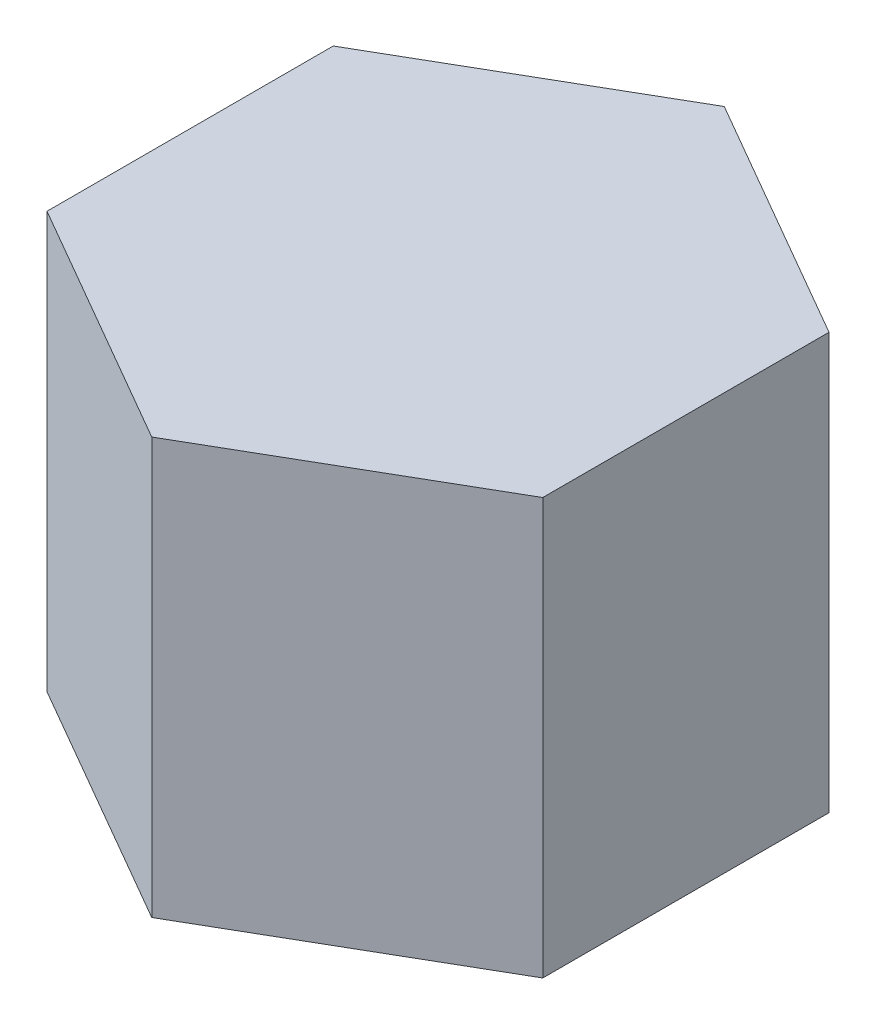
ISO-10303-21;
HEADER;
FILE_DESCRIPTION(('STEP AP214'),'2;1');
FILE_NAME('part.step','',(''),(''),'','','');
FILE_SCHEMA(('AUTOMOTIVE_DESIGN { 1 0 10303 214 1 1 1 1 }'));
ENDSEC;
DATA;
#1=APPLICATION_CONTEXT('core data for automotive mechanical design processes');
#2=APPLICATION_PROTOCOL_DEFINITION('international standard','automotive_design',2000,#1);
#3=PRODUCT_CONTEXT('',#1,'mechanical');
#4=PRODUCT('Part','Part','',(#3));
#5=PRODUCT_RELATED_PRODUCT_CATEGORY('part','',(#4));
#6=PRODUCT_DEFINITION_FORMATION('','',#4);
#7=PRODUCT_DEFINITION_CONTEXT('part definition',#1,'design');
#8=PRODUCT_DEFINITION('design','',#6,#7);
#9=PRODUCT_DEFINITION_SHAPE('','',#8);
#10=(LENGTH_UNIT() NAMED_UNIT(*) SI_UNIT(.MILLI.,.METRE.));
#11=(NAMED_UNIT(*) PLANE_ANGLE_UNIT() SI_UNIT($,.RADIAN.));
#12=(NAMED_UNIT(*) SI_UNIT($,.STERADIAN.) SOLID_ANGLE_UNIT());
#13=UNCERTAINTY_MEASURE_WITH_UNIT(LENGTH_MEASURE(1.E-05),#10,'distance_accuracy_value','');
#14=(GEOMETRIC_REPRESENTATION_CONTEXT(3) GLOBAL_UNCERTAINTY_ASSIGNED_CONTEXT((#13)) GLOBAL_UNIT_ASSIGNED_CONTEXT((#10,
#11,#12)) REPRESENTATION_CONTEXT('',''));
#15=CARTESIAN_POINT('',(0.,0.,0.));
#16=DIRECTION('',(0.,0.,1.));
#17=DIRECTION('',(1.,0.,0.));
#18=AXIS2_PLACEMENT_3D('',#15,#16,#17);
#19=CARTESIAN_POINT('',(203.839551417382,-147.556598747966,287.351844201572));
#20=DIRECTION('',(-0.499999999999943,0.,-0.866025403784471));
#21=DIRECTION('',(-0.866025403784471,0.,0.499999999999943));
#22=AXIS2_PLACEMENT_3D('',#19,#20,#21);
#23=PLANE('',#22);
#24=CARTESIAN_POINT('',(204.142660308706,-147.047793579175,287.176844201572));
#25=DIRECTION('',(-0.866025403784471,0.,0.499999999999943));
#26=VECTOR('',#25,1.);
#27=LINE('',#24,#26);
#28=CARTESIAN_POINT('',(204.142660308706,-147.047793579175,287.176844201572));
#29=VERTEX_POINT('',#28);
#30=CARTESIAN_POINT('',(203.839551417382,-147.047793579175,287.351844201572));
#31=VERTEX_POINT('',#30);
#32=EDGE_CURVE('E170',#29,#31,#27,.T.);
#33=ORIENTED_EDGE('',*,*,#32,.T.);
#34=CARTESIAN_POINT('',(203.839551417382,-147.556598747966,287.351844201572));
#35=DIRECTION('',(0.,1.,0.));
#36=VECTOR('',#35,1.);
#37=LINE('',#34,#36);
#38=CARTESIAN_POINT('',(203.839551417382,-147.556598747966,287.351844201572));
#39=VERTEX_POINT('',#38);
#40=EDGE_CURVE('E35',#39,#31,#37,.T.);
#41=ORIENTED_EDGE('',*,*,#40,.F.);
#42=CARTESIAN_POINT('',(204.142660308706,-147.556598747966,287.176844201572));
#43=DIRECTION('',(-0.866025403784471,0.,0.499999999999943));
#44=VECTOR('',#43,1.);
#45=LINE('',#42,#44);
#46=CARTESIAN_POINT('',(204.142660308706,-147.556598747966,287.176844201572));
#47=VERTEX_POINT('',#46);
#48=EDGE_CURVE('E159',#47,#39,#45,.T.);
#49=ORIENTED_EDGE('',*,*,#48,.F.);
#50=CARTESIAN_POINT('',(204.142660308706,-147.556598747966,287.176844201572));
#51=DIRECTION('',(0.,1.,0.));
#52=VECTOR('',#51,1.);
#53=LINE('',#50,#52);
#54=EDGE_CURVE('E10',#47,#29,#53,.T.);
#55=ORIENTED_EDGE('',*,*,#54,.T.);
#56=EDGE_LOOP('',(#33,#41,#49,#55));
#57=FACE_BOUND('',#56,.T.);
#58=ADVANCED_FACE('F16',(#57),#23,.F.);
#59=CARTESIAN_POINT('',(204.142660308706,-147.556598747966,291.594471220494));
#60=DIRECTION('',(-1.,0.,0.));
#61=DIRECTION('',(0.,-1.,0.));
#62=AXIS2_PLACEMENT_3D('',#59,#60,#61);
#63=PLANE('',#62);
#64=CARTESIAN_POINT('',(204.142660308706,-147.047793579175,286.826844201572));
#65=DIRECTION('',(0.,0.,1.));
#66=VECTOR('',#65,1.);
#67=LINE('',#64,#66);
#68=CARTESIAN_POINT('',(204.142660308706,-147.047793579175,286.826844201572));
#69=VERTEX_POINT('',#68);
#70=EDGE_CURVE('E167',#69,#29,#67,.T.);
#71=ORIENTED_EDGE('',*,*,#70,.T.);
#72=ORIENTED_EDGE('',*,*,#54,.F.);
#73=CARTESIAN_POINT('',(204.142660308706,-147.556598747966,286.826844201572));
#74=DIRECTION('',(0.,0.,1.));
#75=VECTOR('',#74,1.);
#76=LINE('',#73,#75);
#77=CARTESIAN_POINT('',(204.142660308706,-147.556598747966,286.826844201572));
#78=VERTEX_POINT('',#77);
#79=EDGE_CURVE('E156',#78,#47,#76,.T.);
#80=ORIENTED_EDGE('',*,*,#79,.F.);
#81=CARTESIAN_POINT('',(204.142660308706,-147.556598747966,286.826844201572));
#82=DIRECTION('',(0.,1.,0.));
#83=VECTOR('',#82,1.);
#84=LINE('',#81,#83);
#85=EDGE_CURVE('E27',#78,#69,#84,.T.);
#86=ORIENTED_EDGE('',*,*,#85,.T.);
#87=EDGE_LOOP('',(#71,#72,#80,#86));
#88=FACE_BOUND('',#87,.T.);
#89=ADVANCED_FACE('F189',(#88),#63,.F.);
#90=CARTESIAN_POINT('',(204.142660308706,-147.556598747966,286.826844201572));
#91=DIRECTION('',(-0.499999999999943,0.,0.866025403784471));
#92=DIRECTION('',(0.866025403784471,0.,0.499999999999943));
#93=AXIS2_PLACEMENT_3D('',#90,#91,#92);
#94=PLANE('',#93);
#95=CARTESIAN_POINT('',(203.839551417382,-147.047793579175,286.651844201572));
#96=DIRECTION('',(0.866025403784471,0.,0.499999999999943));
#97=VECTOR('',#96,1.);
#98=LINE('',#95,#97);
#99=CARTESIAN_POINT('',(203.839551417382,-147.047793579175,286.651844201572));
#100=VERTEX_POINT('',#99);
#101=EDGE_CURVE('E163',#100,#69,#98,.T.);
#102=ORIENTED_EDGE('',*,*,#101,.T.);
#103=ORIENTED_EDGE('',*,*,#85,.F.);
#104=CARTESIAN_POINT('',(203.839551417382,-147.556598747966,286.651844201572));
#105=DIRECTION('',(0.866025403784471,0.,0.499999999999943));
#106=VECTOR('',#105,1.);
#107=LINE('',#104,#106);
#108=CARTESIAN_POINT('',(203.839551417382,-147.556598747966,286.651844201572));
#109=VERTEX_POINT('',#108);
#110=EDGE_CURVE('E106',#109,#78,#107,.T.);
#111=ORIENTED_EDGE('',*,*,#110,.F.);
#112=CARTESIAN_POINT('',(203.839551417382,-147.556598747966,286.651844201572));
#113=DIRECTION('',(0.,1.,0.));
#114=VECTOR('',#113,1.);
#115=LINE('',#112,#114);
#116=EDGE_CURVE('E94',#109,#100,#115,.T.);
#117=ORIENTED_EDGE('',*,*,#116,.T.);
#118=EDGE_LOOP('',(#102,#103,#111,#117));
#119=FACE_BOUND('',#118,.T.);
#120=ADVANCED_FACE('F198',(#119),#94,.F.);
#121=CARTESIAN_POINT('',(203.839551417382,-147.556598747966,286.651844201572));
#122=DIRECTION('',(0.499999999999978,0.,0.866025403784452));
#123=DIRECTION('',(0.866025403784452,0.,-0.499999999999978));
#124=AXIS2_PLACEMENT_3D('',#121,#122,#123);
#125=PLANE('',#124);
#126=CARTESIAN_POINT('',(203.536442526057,-147.047793579175,286.826844201572));
#127=DIRECTION('',(0.866025403784452,0.,-0.499999999999978));
#128=VECTOR('',#127,1.);
#129=LINE('',#126,#128);
#130=CARTESIAN_POINT('',(203.536442526057,-147.047793579175,286.826844201572));
#131=VERTEX_POINT('',#130);
#132=EDGE_CURVE('E162',#131,#100,#129,.T.);
#133=ORIENTED_EDGE('',*,*,#132,.T.);
#134=ORIENTED_EDGE('',*,*,#116,.F.);
#135=CARTESIAN_POINT('',(203.536442526057,-147.556598747966,286.826844201572));
#136=DIRECTION('',(0.866025403784452,0.,-0.499999999999978));
#137=VECTOR('',#136,1.);
#138=LINE('',#135,#137);
#139=CARTESIAN_POINT('',(203.536442526057,-147.556598747966,286.826844201572));
#140=VERTEX_POINT('',#139);
#141=EDGE_CURVE('E98',#140,#109,#138,.T.);
#142=ORIENTED_EDGE('',*,*,#141,.F.);
#143=CARTESIAN_POINT('',(203.536442526057,-147.556598747966,286.826844201572));
#144=DIRECTION('',(0.,1.,0.));
#145=VECTOR('',#144,1.);
#146=LINE('',#143,#145);
#147=EDGE_CURVE('E79',#140,#131,#146,.T.);
#148=ORIENTED_EDGE('',*,*,#147,.T.);
#149=EDGE_LOOP('',(#133,#134,#142,#148));
#150=FACE_BOUND('',#149,.T.);
#151=ADVANCED_FACE('F100',(#150),#125,.F.);
#152=CARTESIAN_POINT('',(203.536442526057,-147.556598747966,291.594471220494));
#153=DIRECTION('',(1.,0.,0.));
#154=DIRECTION('',(0.,1.,0.));
#155=AXIS2_PLACEMENT_3D('',#152,#153,#154);
#156=PLANE('',#155);
#157=CARTESIAN_POINT('',(203.536442526057,-147.047793579175,287.176844201572));
#158=DIRECTION('',(0.,0.,-1.));
#159=VECTOR('',#158,1.);
#160=LINE('',#157,#159);
#161=CARTESIAN_POINT('',(203.536442526057,-147.047793579175,287.176844201572));
#162=VERTEX_POINT('',#161);
#163=EDGE_CURVE('E88',#162,#131,#160,.T.);
#164=ORIENTED_EDGE('',*,*,#163,.T.);
#165=ORIENTED_EDGE('',*,*,#147,.F.);
#166=CARTESIAN_POINT('',(203.536442526057,-147.556598747966,287.176844201572));
#167=DIRECTION('',(0.,0.,-1.));
#168=VECTOR('',#167,1.);
#169=LINE('',#166,#168);
#170=CARTESIAN_POINT('',(203.536442526057,-147.556598747966,287.176844201572));
#171=VERTEX_POINT('',#170);
#172=EDGE_CURVE('E84',#171,#140,#169,.T.);
#173=ORIENTED_EDGE('',*,*,#172,.F.);
#174=CARTESIAN_POINT('',(203.536442526057,-147.556598747966,287.176844201572));
#175=DIRECTION('',(0.,1.,0.));
#176=VECTOR('',#175,1.);
#177=LINE('',#174,#176);
#178=EDGE_CURVE('E58',#171,#162,#177,.T.);
#179=ORIENTED_EDGE('',*,*,#178,.T.);
#180=EDGE_LOOP('',(#164,#165,#173,#179));
#181=FACE_BOUND('',#180,.T.);
#182=ADVANCED_FACE('F82',(#181),#156,.F.);
#183=CARTESIAN_POINT('',(203.536442526057,-147.556598747966,287.176844201572));
#184=DIRECTION('',(0.499999999999978,0.,-0.866025403784452));
#185=DIRECTION('',(-0.866025403784452,0.,-0.499999999999978));
#186=AXIS2_PLACEMENT_3D('',#183,#184,#185);
#187=PLANE('',#186);
#188=CARTESIAN_POINT('',(203.839551417382,-147.047793579175,287.351844201572));
#189=DIRECTION('',(-0.866025403784452,0.,-0.499999999999978));
#190=VECTOR('',#189,1.);
#191=LINE('',#188,#190);
#192=EDGE_CURVE('E160',#31,#162,#191,.T.);
#193=ORIENTED_EDGE('',*,*,#192,.T.);
#194=ORIENTED_EDGE('',*,*,#178,.F.);
#195=CARTESIAN_POINT('',(203.839551417382,-147.556598747966,287.351844201572));
#196=DIRECTION('',(-0.866025403784452,0.,-0.499999999999978));
#197=VECTOR('',#196,1.);
#198=LINE('',#195,#197);
#199=EDGE_CURVE('E112',#39,#171,#198,.T.);
#200=ORIENTED_EDGE('',*,*,#199,.F.);
#201=ORIENTED_EDGE('',*,*,#40,.T.);
#202=EDGE_LOOP('',(#193,#194,#200,#201));
#203=FACE_BOUND('',#202,.T.);
#204=ADVANCED_FACE('F131',(#203),#187,.F.);
#205=CARTESIAN_POINT('',(206.491105863044,-147.556598747966,291.594471220494));
#206=DIRECTION('',(0.,1.,0.));
#207=DIRECTION('',(-1.,0.,0.));
#208=AXIS2_PLACEMENT_3D('',#205,#206,#207);
#209=PLANE('',#208);
#210=ORIENTED_EDGE('',*,*,#48,.T.);
#211=ORIENTED_EDGE('',*,*,#199,.T.);
#212=ORIENTED_EDGE('',*,*,#172,.T.);
#213=ORIENTED_EDGE('',*,*,#141,.T.);
#214=ORIENTED_EDGE('',*,*,#110,.T.);
#215=ORIENTED_EDGE('',*,*,#79,.T.);
#216=EDGE_LOOP('',(#210,#211,#212,#213,#214,#215));
#217=FACE_BOUND('',#216,.T.);
#218=ADVANCED_FACE('F111',(#217),#209,.F.);
#219=CARTESIAN_POINT('',(206.491105863044,-147.047793579175,291.594471220494));
#220=DIRECTION('',(0.,1.,0.));
#221=DIRECTION('',(-1.,0.,0.));
#222=AXIS2_PLACEMENT_3D('',#219,#220,#221);
#223=PLANE('',#222);
#224=ORIENTED_EDGE('',*,*,#32,.F.);
#225=ORIENTED_EDGE('',*,*,#70,.F.);
#226=ORIENTED_EDGE('',*,*,#101,.F.);
#227=ORIENTED_EDGE('',*,*,#132,.F.);
#228=ORIENTED_EDGE('',*,*,#163,.F.);
#229=ORIENTED_EDGE('',*,*,#192,.F.);
#230=EDGE_LOOP('',(#224,#225,#226,#227,#228,#229));
#231=FACE_BOUND('',#230,.T.);
#232=ADVANCED_FACE('F130',(#231),#223,.T.);
#233=CLOSED_SHELL('',(#58,#89,#120,#151,#182,#204,#218,#232));
#234=MANIFOLD_SOLID_BREP('B1',#233);
#235=ADVANCED_BREP_SHAPE_REPRESENTATION('',(#18,#234),#14);
#236=SHAPE_DEFINITION_REPRESENTATION(#9,#235);
ENDSEC;
END-ISO-10303-21;
